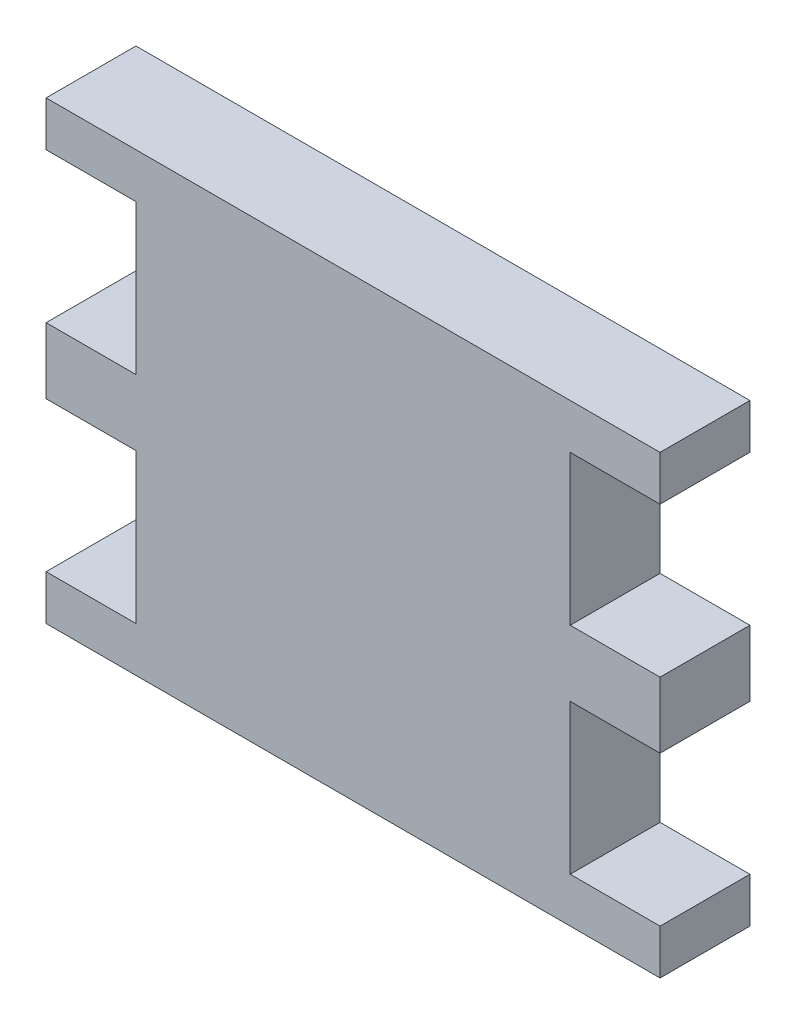
ISO-10303-21;
HEADER;
FILE_DESCRIPTION(('STEP AP214'),'2;1');
FILE_NAME('part.step','',(''),(''),'','','');
FILE_SCHEMA(('AUTOMOTIVE_DESIGN { 1 0 10303 214 1 1 1 1 }'));
ENDSEC;
DATA;
#1=APPLICATION_CONTEXT('core data for automotive mechanical design processes');
#2=APPLICATION_PROTOCOL_DEFINITION('international standard','automotive_design',2000,#1);
#3=PRODUCT_CONTEXT('',#1,'mechanical');
#4=PRODUCT('Part','Part','',(#3));
#5=PRODUCT_RELATED_PRODUCT_CATEGORY('part','',(#4));
#6=PRODUCT_DEFINITION_FORMATION('','',#4);
#7=PRODUCT_DEFINITION_CONTEXT('part definition',#1,'design');
#8=PRODUCT_DEFINITION('design','',#6,#7);
#9=PRODUCT_DEFINITION_SHAPE('','',#8);
#10=(LENGTH_UNIT() NAMED_UNIT(*) SI_UNIT(.MILLI.,.METRE.));
#11=(NAMED_UNIT(*) PLANE_ANGLE_UNIT() SI_UNIT($,.RADIAN.));
#12=(NAMED_UNIT(*) SI_UNIT($,.STERADIAN.) SOLID_ANGLE_UNIT());
#13=UNCERTAINTY_MEASURE_WITH_UNIT(LENGTH_MEASURE(1.E-05),#10,'distance_accuracy_value','');
#14=(GEOMETRIC_REPRESENTATION_CONTEXT(3) GLOBAL_UNCERTAINTY_ASSIGNED_CONTEXT((#13)) GLOBAL_UNIT_ASSIGNED_CONTEXT((#10,
#11,#12)) REPRESENTATION_CONTEXT('',''));
#15=CARTESIAN_POINT('',(0.,0.,0.));
#16=DIRECTION('',(0.,0.,1.));
#17=DIRECTION('',(1.,0.,0.));
#18=AXIS2_PLACEMENT_3D('',#15,#16,#17);
#19=CARTESIAN_POINT('',(-20.5,11.5114427860697,6.));
#20=DIRECTION('',(0.,1.,0.));
#21=DIRECTION('',(-1.,0.,0.));
#22=AXIS2_PLACEMENT_3D('',#19,#20,#21);
#23=PLANE('',#22);
#24=DIRECTION('',(1.,0.,0.));
#25=VECTOR('',#24,1.);
#26=CARTESIAN_POINT('',(-20.5,11.5114427860697,0.));
#27=LINE('',#26,#25);
#28=CARTESIAN_POINT('',(-20.5,11.5114427860697,0.));
#29=VERTEX_POINT('',#28);
#30=CARTESIAN_POINT('',(-14.5,11.5114427860696,0.));
#31=VERTEX_POINT('',#30);
#32=EDGE_CURVE('E201',#29,#31,#27,.T.);
#33=ORIENTED_EDGE('',*,*,#32,.T.);
#34=DIRECTION('',(0.,0.,-1.));
#35=VECTOR('',#34,1.);
#36=CARTESIAN_POINT('',(-14.5,11.5114427860696,6.));
#37=LINE('',#36,#35);
#38=CARTESIAN_POINT('',(-14.5,11.5114427860696,6.));
#39=VERTEX_POINT('',#38);
#40=EDGE_CURVE('E11',#39,#31,#37,.T.);
#41=ORIENTED_EDGE('',*,*,#40,.F.);
#42=DIRECTION('',(1.,0.,0.));
#43=VECTOR('',#42,1.);
#44=CARTESIAN_POINT('',(-20.5,11.5114427860697,6.));
#45=LINE('',#44,#43);
#46=CARTESIAN_POINT('',(-20.5,11.5114427860697,6.));
#47=VERTEX_POINT('',#46);
#48=EDGE_CURVE('E239',#47,#39,#45,.T.);
#49=ORIENTED_EDGE('',*,*,#48,.F.);
#50=DIRECTION('',(0.,0.,-1.));
#51=VECTOR('',#50,1.);
#52=CARTESIAN_POINT('',(-20.5,11.5114427860697,6.));
#53=LINE('',#52,#51);
#54=EDGE_CURVE('E197',#47,#29,#53,.T.);
#55=ORIENTED_EDGE('',*,*,#54,.T.);
#56=EDGE_LOOP('',(#33,#41,#49,#55));
#57=FACE_BOUND('',#56,.T.);
#58=ADVANCED_FACE('F33',(#57),#23,.F.);
#59=CARTESIAN_POINT('',(-14.5,11.5114427860696,6.));
#60=DIRECTION('',(1.,0.,0.));
#61=DIRECTION('',(0.,1.,0.));
#62=AXIS2_PLACEMENT_3D('',#59,#60,#61);
#63=PLANE('',#62);
#64=DIRECTION('',(0.,-1.,0.));
#65=VECTOR('',#64,1.);
#66=CARTESIAN_POINT('',(-14.5,11.5114427860696,0.));
#67=LINE('',#66,#65);
#68=CARTESIAN_POINT('',(-14.5,1.51144278606965,0.));
#69=VERTEX_POINT('',#68);
#70=EDGE_CURVE('E204',#31,#69,#67,.T.);
#71=ORIENTED_EDGE('',*,*,#70,.T.);
#72=DIRECTION('',(0.,0.,-1.));
#73=VECTOR('',#72,1.);
#74=CARTESIAN_POINT('',(-14.5,1.51144278606965,6.));
#75=LINE('',#74,#73);
#76=CARTESIAN_POINT('',(-14.5,1.51144278606965,6.));
#77=VERTEX_POINT('',#76);
#78=EDGE_CURVE('E41',#77,#69,#75,.T.);
#79=ORIENTED_EDGE('',*,*,#78,.F.);
#80=DIRECTION('',(0.,-1.,0.));
#81=VECTOR('',#80,1.);
#82=CARTESIAN_POINT('',(-14.5,11.5114427860696,6.));
#83=LINE('',#82,#81);
#84=EDGE_CURVE('E128',#39,#77,#83,.T.);
#85=ORIENTED_EDGE('',*,*,#84,.F.);
#86=ORIENTED_EDGE('',*,*,#40,.T.);
#87=EDGE_LOOP('',(#71,#79,#85,#86));
#88=FACE_BOUND('',#87,.T.);
#89=ADVANCED_FACE('F357',(#88),#63,.F.);
#90=CARTESIAN_POINT('',(-14.5,1.51144278606965,6.));
#91=DIRECTION('',(0.,-1.,0.));
#92=DIRECTION('',(1.,0.,0.));
#93=AXIS2_PLACEMENT_3D('',#90,#91,#92);
#94=PLANE('',#93);
#95=DIRECTION('',(-1.,0.,0.));
#96=VECTOR('',#95,1.);
#97=CARTESIAN_POINT('',(-14.5,1.51144278606965,0.));
#98=LINE('',#97,#96);
#99=CARTESIAN_POINT('',(-20.5,1.51144278606965,0.));
#100=VERTEX_POINT('',#99);
#101=EDGE_CURVE('E206',#69,#100,#98,.T.);
#102=ORIENTED_EDGE('',*,*,#101,.T.);
#103=DIRECTION('',(0.,0.,-1.));
#104=VECTOR('',#103,1.);
#105=CARTESIAN_POINT('',(-20.5,1.51144278606965,6.));
#106=LINE('',#105,#104);
#107=CARTESIAN_POINT('',(-20.5,1.51144278606965,6.));
#108=VERTEX_POINT('',#107);
#109=EDGE_CURVE('E282',#108,#100,#106,.T.);
#110=ORIENTED_EDGE('',*,*,#109,.F.);
#111=DIRECTION('',(-1.,0.,0.));
#112=VECTOR('',#111,1.);
#113=CARTESIAN_POINT('',(-14.5,1.51144278606965,6.));
#114=LINE('',#113,#112);
#115=EDGE_CURVE('E290',#77,#108,#114,.T.);
#116=ORIENTED_EDGE('',*,*,#115,.F.);
#117=ORIENTED_EDGE('',*,*,#78,.T.);
#118=EDGE_LOOP('',(#102,#110,#116,#117));
#119=FACE_BOUND('',#118,.T.);
#120=ADVANCED_FACE('F288',(#119),#94,.F.);
#121=CARTESIAN_POINT('',(-20.5,1.51144278606965,6.));
#122=DIRECTION('',(1.,0.,0.));
#123=DIRECTION('',(0.,0.,-1.));
#124=AXIS2_PLACEMENT_3D('',#121,#122,#123);
#125=PLANE('',#124);
#126=DIRECTION('',(0.,-1.,0.));
#127=VECTOR('',#126,1.);
#128=CARTESIAN_POINT('',(-20.5,1.51144278606965,0.));
#129=LINE('',#128,#127);
#130=CARTESIAN_POINT('',(-20.5,-2.88855721393036,0.));
#131=VERTEX_POINT('',#130);
#132=EDGE_CURVE('E208',#100,#131,#129,.T.);
#133=ORIENTED_EDGE('',*,*,#132,.T.);
#134=DIRECTION('',(0.,0.,-1.));
#135=VECTOR('',#134,1.);
#136=CARTESIAN_POINT('',(-20.5,-2.88855721393036,6.));
#137=LINE('',#136,#135);
#138=CARTESIAN_POINT('',(-20.5,-2.88855721393036,6.));
#139=VERTEX_POINT('',#138);
#140=EDGE_CURVE('E279',#139,#131,#137,.T.);
#141=ORIENTED_EDGE('',*,*,#140,.F.);
#142=DIRECTION('',(0.,-1.,0.));
#143=VECTOR('',#142,1.);
#144=CARTESIAN_POINT('',(-20.5,1.51144278606965,6.));
#145=LINE('',#144,#143);
#146=EDGE_CURVE('E308',#108,#139,#145,.T.);
#147=ORIENTED_EDGE('',*,*,#146,.F.);
#148=ORIENTED_EDGE('',*,*,#109,.T.);
#149=EDGE_LOOP('',(#133,#141,#147,#148));
#150=FACE_BOUND('',#149,.T.);
#151=ADVANCED_FACE('F299',(#150),#125,.F.);
#152=CARTESIAN_POINT('',(-20.5,-2.88855721393036,6.));
#153=DIRECTION('',(0.,1.,0.));
#154=DIRECTION('',(-1.,0.,0.));
#155=AXIS2_PLACEMENT_3D('',#152,#153,#154);
#156=PLANE('',#155);
#157=DIRECTION('',(1.,0.,0.));
#158=VECTOR('',#157,1.);
#159=CARTESIAN_POINT('',(-20.5,-2.88855721393036,0.));
#160=LINE('',#159,#158);
#161=CARTESIAN_POINT('',(-14.5,-2.88855721393035,0.));
#162=VERTEX_POINT('',#161);
#163=EDGE_CURVE('E210',#131,#162,#160,.T.);
#164=ORIENTED_EDGE('',*,*,#163,.T.);
#165=DIRECTION('',(0.,0.,-1.));
#166=VECTOR('',#165,1.);
#167=CARTESIAN_POINT('',(-14.5,-2.88855721393035,6.));
#168=LINE('',#167,#166);
#169=CARTESIAN_POINT('',(-14.5,-2.88855721393035,6.));
#170=VERTEX_POINT('',#169);
#171=EDGE_CURVE('E276',#170,#162,#168,.T.);
#172=ORIENTED_EDGE('',*,*,#171,.F.);
#173=DIRECTION('',(1.,0.,0.));
#174=VECTOR('',#173,1.);
#175=CARTESIAN_POINT('',(-20.5,-2.88855721393036,6.));
#176=LINE('',#175,#174);
#177=EDGE_CURVE('E305',#139,#170,#176,.T.);
#178=ORIENTED_EDGE('',*,*,#177,.F.);
#179=ORIENTED_EDGE('',*,*,#140,.T.);
#180=EDGE_LOOP('',(#164,#172,#178,#179));
#181=FACE_BOUND('',#180,.T.);
#182=ADVANCED_FACE('F303',(#181),#156,.F.);
#183=CARTESIAN_POINT('',(-14.5,-2.88855721393035,6.));
#184=DIRECTION('',(1.,0.,0.));
#185=DIRECTION('',(0.,1.,0.));
#186=AXIS2_PLACEMENT_3D('',#183,#184,#185);
#187=PLANE('',#186);
#188=DIRECTION('',(0.,-1.,0.));
#189=VECTOR('',#188,1.);
#190=CARTESIAN_POINT('',(-14.5,-2.88855721393035,0.));
#191=LINE('',#190,#189);
#192=CARTESIAN_POINT('',(-14.5,-12.8885572139304,0.));
#193=VERTEX_POINT('',#192);
#194=EDGE_CURVE('E212',#162,#193,#191,.T.);
#195=ORIENTED_EDGE('',*,*,#194,.T.);
#196=DIRECTION('',(0.,0.,-1.));
#197=VECTOR('',#196,1.);
#198=CARTESIAN_POINT('',(-14.5,-12.8885572139304,6.));
#199=LINE('',#198,#197);
#200=CARTESIAN_POINT('',(-14.5,-12.8885572139304,6.));
#201=VERTEX_POINT('',#200);
#202=EDGE_CURVE('E273',#201,#193,#199,.T.);
#203=ORIENTED_EDGE('',*,*,#202,.F.);
#204=DIRECTION('',(0.,-1.,0.));
#205=VECTOR('',#204,1.);
#206=CARTESIAN_POINT('',(-14.5,-2.88855721393035,6.));
#207=LINE('',#206,#205);
#208=EDGE_CURVE('E307',#170,#201,#207,.T.);
#209=ORIENTED_EDGE('',*,*,#208,.F.);
#210=ORIENTED_EDGE('',*,*,#171,.T.);
#211=EDGE_LOOP('',(#195,#203,#209,#210));
#212=FACE_BOUND('',#211,.T.);
#213=ADVANCED_FACE('F370',(#212),#187,.F.);
#214=CARTESIAN_POINT('',(-14.5,-12.8885572139304,6.));
#215=DIRECTION('',(0.,-1.,0.));
#216=DIRECTION('',(1.,0.,0.));
#217=AXIS2_PLACEMENT_3D('',#214,#215,#216);
#218=PLANE('',#217);
#219=DIRECTION('',(-1.,0.,0.));
#220=VECTOR('',#219,1.);
#221=CARTESIAN_POINT('',(-14.5,-12.8885572139304,0.));
#222=LINE('',#221,#220);
#223=CARTESIAN_POINT('',(-20.5,-12.8885572139304,0.));
#224=VERTEX_POINT('',#223);
#225=EDGE_CURVE('E214',#193,#224,#222,.T.);
#226=ORIENTED_EDGE('',*,*,#225,.T.);
#227=DIRECTION('',(0.,0.,-1.));
#228=VECTOR('',#227,1.);
#229=CARTESIAN_POINT('',(-20.5,-12.8885572139304,6.));
#230=LINE('',#229,#228);
#231=CARTESIAN_POINT('',(-20.5,-12.8885572139304,6.));
#232=VERTEX_POINT('',#231);
#233=EDGE_CURVE('E270',#232,#224,#230,.T.);
#234=ORIENTED_EDGE('',*,*,#233,.F.);
#235=DIRECTION('',(-1.,0.,0.));
#236=VECTOR('',#235,1.);
#237=CARTESIAN_POINT('',(-14.5,-12.8885572139304,6.));
#238=LINE('',#237,#236);
#239=EDGE_CURVE('E310',#201,#232,#238,.T.);
#240=ORIENTED_EDGE('',*,*,#239,.F.);
#241=ORIENTED_EDGE('',*,*,#202,.T.);
#242=EDGE_LOOP('',(#226,#234,#240,#241));
#243=FACE_BOUND('',#242,.T.);
#244=ADVANCED_FACE('F373',(#243),#218,.F.);
#245=CARTESIAN_POINT('',(-20.5,-12.8885572139304,6.));
#246=DIRECTION('',(1.,0.,0.));
#247=DIRECTION('',(0.,1.,0.));
#248=AXIS2_PLACEMENT_3D('',#245,#246,#247);
#249=PLANE('',#248);
#250=DIRECTION('',(0.,-1.,0.));
#251=VECTOR('',#250,1.);
#252=CARTESIAN_POINT('',(-20.5,-12.8885572139304,0.));
#253=LINE('',#252,#251);
#254=CARTESIAN_POINT('',(-20.5,-15.8885572139303,0.));
#255=VERTEX_POINT('',#254);
#256=EDGE_CURVE('E216',#224,#255,#253,.T.);
#257=ORIENTED_EDGE('',*,*,#256,.T.);
#258=DIRECTION('',(0.,0.,-1.));
#259=VECTOR('',#258,1.);
#260=CARTESIAN_POINT('',(-20.5,-15.8885572139303,6.));
#261=LINE('',#260,#259);
#262=CARTESIAN_POINT('',(-20.5,-15.8885572139303,6.));
#263=VERTEX_POINT('',#262);
#264=EDGE_CURVE('E267',#263,#255,#261,.T.);
#265=ORIENTED_EDGE('',*,*,#264,.F.);
#266=DIRECTION('',(0.,-1.,0.));
#267=VECTOR('',#266,1.);
#268=CARTESIAN_POINT('',(-20.5,-12.8885572139304,6.));
#269=LINE('',#268,#267);
#270=EDGE_CURVE('E316',#232,#263,#269,.T.);
#271=ORIENTED_EDGE('',*,*,#270,.F.);
#272=ORIENTED_EDGE('',*,*,#233,.T.);
#273=EDGE_LOOP('',(#257,#265,#271,#272));
#274=FACE_BOUND('',#273,.T.);
#275=ADVANCED_FACE('F377',(#274),#249,.F.);
#276=CARTESIAN_POINT('',(-20.5,-15.8885572139303,6.));
#277=DIRECTION('',(0.,1.,0.));
#278=DIRECTION('',(-1.,0.,0.));
#279=AXIS2_PLACEMENT_3D('',#276,#277,#278);
#280=PLANE('',#279);
#281=DIRECTION('',(1.,0.,0.));
#282=VECTOR('',#281,1.);
#283=CARTESIAN_POINT('',(-20.5,-15.8885572139303,0.));
#284=LINE('',#283,#282);
#285=CARTESIAN_POINT('',(20.5,-15.8885572139303,0.));
#286=VERTEX_POINT('',#285);
#287=EDGE_CURVE('E218',#255,#286,#284,.T.);
#288=ORIENTED_EDGE('',*,*,#287,.T.);
#289=DIRECTION('',(0.,0.,-1.));
#290=VECTOR('',#289,1.);
#291=CARTESIAN_POINT('',(20.5,-15.8885572139303,6.));
#292=LINE('',#291,#290);
#293=CARTESIAN_POINT('',(20.5,-15.8885572139303,6.));
#294=VERTEX_POINT('',#293);
#295=EDGE_CURVE('E264',#294,#286,#292,.T.);
#296=ORIENTED_EDGE('',*,*,#295,.F.);
#297=DIRECTION('',(1.,0.,0.));
#298=VECTOR('',#297,1.);
#299=CARTESIAN_POINT('',(-20.5,-15.8885572139303,6.));
#300=LINE('',#299,#298);
#301=EDGE_CURVE('E318',#263,#294,#300,.T.);
#302=ORIENTED_EDGE('',*,*,#301,.F.);
#303=ORIENTED_EDGE('',*,*,#264,.T.);
#304=EDGE_LOOP('',(#288,#296,#302,#303));
#305=FACE_BOUND('',#304,.T.);
#306=ADVANCED_FACE('F381',(#305),#280,.F.);
#307=CARTESIAN_POINT('',(20.5,-12.8885572139303,6.));
#308=DIRECTION('',(-1.,0.,0.));
#309=DIRECTION('',(0.,-1.,0.));
#310=AXIS2_PLACEMENT_3D('',#307,#308,#309);
#311=PLANE('',#310);
#312=DIRECTION('',(0.,1.,0.));
#313=VECTOR('',#312,1.);
#314=CARTESIAN_POINT('',(20.5,-12.8885572139303,0.));
#315=LINE('',#314,#313);
#316=CARTESIAN_POINT('',(20.5,-12.8885572139303,0.));
#317=VERTEX_POINT('',#316);
#318=EDGE_CURVE('E220',#286,#317,#315,.T.);
#319=ORIENTED_EDGE('',*,*,#318,.T.);
#320=DIRECTION('',(0.,0.,-1.));
#321=VECTOR('',#320,1.);
#322=CARTESIAN_POINT('',(20.5,-12.8885572139303,6.));
#323=LINE('',#322,#321);
#324=CARTESIAN_POINT('',(20.5,-12.8885572139303,6.));
#325=VERTEX_POINT('',#324);
#326=EDGE_CURVE('E261',#325,#317,#323,.T.);
#327=ORIENTED_EDGE('',*,*,#326,.F.);
#328=DIRECTION('',(0.,1.,0.));
#329=VECTOR('',#328,1.);
#330=CARTESIAN_POINT('',(20.5,-12.8885572139303,6.));
#331=LINE('',#330,#329);
#332=EDGE_CURVE('E320',#294,#325,#331,.T.);
#333=ORIENTED_EDGE('',*,*,#332,.F.);
#334=ORIENTED_EDGE('',*,*,#295,.T.);
#335=EDGE_LOOP('',(#319,#327,#333,#334));
#336=FACE_BOUND('',#335,.T.);
#337=ADVANCED_FACE('F385',(#336),#311,.F.);
#338=CARTESIAN_POINT('',(14.5,-12.8885572139304,6.));
#339=DIRECTION('',(0.,-1.,0.));
#340=DIRECTION('',(1.,0.,0.));
#341=AXIS2_PLACEMENT_3D('',#338,#339,#340);
#342=PLANE('',#341);
#343=DIRECTION('',(-1.,0.,0.));
#344=VECTOR('',#343,1.);
#345=CARTESIAN_POINT('',(14.5,-12.8885572139304,0.));
#346=LINE('',#345,#344);
#347=CARTESIAN_POINT('',(14.5,-12.8885572139304,0.));
#348=VERTEX_POINT('',#347);
#349=EDGE_CURVE('E222',#317,#348,#346,.T.);
#350=ORIENTED_EDGE('',*,*,#349,.T.);
#351=DIRECTION('',(0.,0.,-1.));
#352=VECTOR('',#351,1.);
#353=CARTESIAN_POINT('',(14.5,-12.8885572139304,6.));
#354=LINE('',#353,#352);
#355=CARTESIAN_POINT('',(14.5,-12.8885572139304,6.));
#356=VERTEX_POINT('',#355);
#357=EDGE_CURVE('E258',#356,#348,#354,.T.);
#358=ORIENTED_EDGE('',*,*,#357,.F.);
#359=DIRECTION('',(-1.,0.,0.));
#360=VECTOR('',#359,1.);
#361=CARTESIAN_POINT('',(14.5,-12.8885572139304,6.));
#362=LINE('',#361,#360);
#363=EDGE_CURVE('E322',#325,#356,#362,.T.);
#364=ORIENTED_EDGE('',*,*,#363,.F.);
#365=ORIENTED_EDGE('',*,*,#326,.T.);
#366=EDGE_LOOP('',(#350,#358,#364,#365));
#367=FACE_BOUND('',#366,.T.);
#368=ADVANCED_FACE('F389',(#367),#342,.F.);
#369=CARTESIAN_POINT('',(14.5,-2.88855721393035,6.));
#370=DIRECTION('',(-1.,0.,0.));
#371=DIRECTION('',(0.,-1.,0.));
#372=AXIS2_PLACEMENT_3D('',#369,#370,#371);
#373=PLANE('',#372);
#374=DIRECTION('',(0.,1.,0.));
#375=VECTOR('',#374,1.);
#376=CARTESIAN_POINT('',(14.5,-2.88855721393035,0.));
#377=LINE('',#376,#375);
#378=CARTESIAN_POINT('',(14.5,-2.88855721393035,0.));
#379=VERTEX_POINT('',#378);
#380=EDGE_CURVE('E224',#348,#379,#377,.T.);
#381=ORIENTED_EDGE('',*,*,#380,.T.);
#382=DIRECTION('',(0.,0.,-1.));
#383=VECTOR('',#382,1.);
#384=CARTESIAN_POINT('',(14.5,-2.88855721393035,6.));
#385=LINE('',#384,#383);
#386=CARTESIAN_POINT('',(14.5,-2.88855721393035,6.));
#387=VERTEX_POINT('',#386);
#388=EDGE_CURVE('E255',#387,#379,#385,.T.);
#389=ORIENTED_EDGE('',*,*,#388,.F.);
#390=DIRECTION('',(0.,1.,0.));
#391=VECTOR('',#390,1.);
#392=CARTESIAN_POINT('',(14.5,-2.88855721393035,6.));
#393=LINE('',#392,#391);
#394=EDGE_CURVE('E324',#356,#387,#393,.T.);
#395=ORIENTED_EDGE('',*,*,#394,.F.);
#396=ORIENTED_EDGE('',*,*,#357,.T.);
#397=EDGE_LOOP('',(#381,#389,#395,#396));
#398=FACE_BOUND('',#397,.T.);
#399=ADVANCED_FACE('F393',(#398),#373,.F.);
#400=CARTESIAN_POINT('',(20.5,-2.88855721393035,6.));
#401=DIRECTION('',(0.,1.,0.));
#402=DIRECTION('',(-1.,0.,0.));
#403=AXIS2_PLACEMENT_3D('',#400,#401,#402);
#404=PLANE('',#403);
#405=DIRECTION('',(1.,0.,0.));
#406=VECTOR('',#405,1.);
#407=CARTESIAN_POINT('',(20.5,-2.88855721393035,0.));
#408=LINE('',#407,#406);
#409=CARTESIAN_POINT('',(20.5,-2.88855721393035,0.));
#410=VERTEX_POINT('',#409);
#411=EDGE_CURVE('E226',#379,#410,#408,.T.);
#412=ORIENTED_EDGE('',*,*,#411,.T.);
#413=DIRECTION('',(0.,0.,-1.));
#414=VECTOR('',#413,1.);
#415=CARTESIAN_POINT('',(20.5,-2.88855721393035,6.));
#416=LINE('',#415,#414);
#417=CARTESIAN_POINT('',(20.5,-2.88855721393035,6.));
#418=VERTEX_POINT('',#417);
#419=EDGE_CURVE('E252',#418,#410,#416,.T.);
#420=ORIENTED_EDGE('',*,*,#419,.F.);
#421=DIRECTION('',(1.,0.,0.));
#422=VECTOR('',#421,1.);
#423=CARTESIAN_POINT('',(20.5,-2.88855721393035,6.));
#424=LINE('',#423,#422);
#425=EDGE_CURVE('E326',#387,#418,#424,.T.);
#426=ORIENTED_EDGE('',*,*,#425,.F.);
#427=ORIENTED_EDGE('',*,*,#388,.T.);
#428=EDGE_LOOP('',(#412,#420,#426,#427));
#429=FACE_BOUND('',#428,.T.);
#430=ADVANCED_FACE('F397',(#429),#404,.F.);
#431=CARTESIAN_POINT('',(20.5,1.51144278606965,6.));
#432=DIRECTION('',(-1.,0.,0.));
#433=DIRECTION('',(0.,0.,1.));
#434=AXIS2_PLACEMENT_3D('',#431,#432,#433);
#435=PLANE('',#434);
#436=DIRECTION('',(0.,1.,0.));
#437=VECTOR('',#436,1.);
#438=CARTESIAN_POINT('',(20.5,1.51144278606965,0.));
#439=LINE('',#438,#437);
#440=CARTESIAN_POINT('',(20.5,1.51144278606965,0.));
#441=VERTEX_POINT('',#440);
#442=EDGE_CURVE('E228',#410,#441,#439,.T.);
#443=ORIENTED_EDGE('',*,*,#442,.T.);
#444=DIRECTION('',(0.,0.,-1.));
#445=VECTOR('',#444,1.);
#446=CARTESIAN_POINT('',(20.5,1.51144278606965,6.));
#447=LINE('',#446,#445);
#448=CARTESIAN_POINT('',(20.5,1.51144278606965,6.));
#449=VERTEX_POINT('',#448);
#450=EDGE_CURVE('E249',#449,#441,#447,.T.);
#451=ORIENTED_EDGE('',*,*,#450,.F.);
#452=DIRECTION('',(0.,1.,0.));
#453=VECTOR('',#452,1.);
#454=CARTESIAN_POINT('',(20.5,1.51144278606965,6.));
#455=LINE('',#454,#453);
#456=EDGE_CURVE('E328',#418,#449,#455,.T.);
#457=ORIENTED_EDGE('',*,*,#456,.F.);
#458=ORIENTED_EDGE('',*,*,#419,.T.);
#459=EDGE_LOOP('',(#443,#451,#457,#458));
#460=FACE_BOUND('',#459,.T.);
#461=ADVANCED_FACE('F401',(#460),#435,.F.);
#462=CARTESIAN_POINT('',(14.5,1.51144278606965,6.));
#463=DIRECTION('',(0.,-1.,0.));
#464=DIRECTION('',(1.,0.,0.));
#465=AXIS2_PLACEMENT_3D('',#462,#463,#464);
#466=PLANE('',#465);
#467=DIRECTION('',(-1.,0.,0.));
#468=VECTOR('',#467,1.);
#469=CARTESIAN_POINT('',(14.5,1.51144278606965,0.));
#470=LINE('',#469,#468);
#471=CARTESIAN_POINT('',(14.5,1.51144278606965,0.));
#472=VERTEX_POINT('',#471);
#473=EDGE_CURVE('E230',#441,#472,#470,.T.);
#474=ORIENTED_EDGE('',*,*,#473,.T.);
#475=DIRECTION('',(0.,0.,-1.));
#476=VECTOR('',#475,1.);
#477=CARTESIAN_POINT('',(14.5,1.51144278606965,6.));
#478=LINE('',#477,#476);
#479=CARTESIAN_POINT('',(14.5,1.51144278606965,6.));
#480=VERTEX_POINT('',#479);
#481=EDGE_CURVE('E246',#480,#472,#478,.T.);
#482=ORIENTED_EDGE('',*,*,#481,.F.);
#483=DIRECTION('',(-1.,0.,0.));
#484=VECTOR('',#483,1.);
#485=CARTESIAN_POINT('',(14.5,1.51144278606965,6.));
#486=LINE('',#485,#484);
#487=EDGE_CURVE('E330',#449,#480,#486,.T.);
#488=ORIENTED_EDGE('',*,*,#487,.F.);
#489=ORIENTED_EDGE('',*,*,#450,.T.);
#490=EDGE_LOOP('',(#474,#482,#488,#489));
#491=FACE_BOUND('',#490,.T.);
#492=ADVANCED_FACE('F405',(#491),#466,.F.);
#493=CARTESIAN_POINT('',(14.5,11.5114427860697,6.));
#494=DIRECTION('',(-1.,0.,0.));
#495=DIRECTION('',(0.,-1.,0.));
#496=AXIS2_PLACEMENT_3D('',#493,#494,#495);
#497=PLANE('',#496);
#498=DIRECTION('',(0.,1.,0.));
#499=VECTOR('',#498,1.);
#500=CARTESIAN_POINT('',(14.5,11.5114427860697,0.));
#501=LINE('',#500,#499);
#502=CARTESIAN_POINT('',(14.5,11.5114427860697,0.));
#503=VERTEX_POINT('',#502);
#504=EDGE_CURVE('E232',#472,#503,#501,.T.);
#505=ORIENTED_EDGE('',*,*,#504,.T.);
#506=DIRECTION('',(0.,0.,-1.));
#507=VECTOR('',#506,1.);
#508=CARTESIAN_POINT('',(14.5,11.5114427860697,6.));
#509=LINE('',#508,#507);
#510=CARTESIAN_POINT('',(14.5,11.5114427860697,6.));
#511=VERTEX_POINT('',#510);
#512=EDGE_CURVE('E243',#511,#503,#509,.T.);
#513=ORIENTED_EDGE('',*,*,#512,.F.);
#514=DIRECTION('',(0.,1.,0.));
#515=VECTOR('',#514,1.);
#516=CARTESIAN_POINT('',(14.5,11.5114427860697,6.));
#517=LINE('',#516,#515);
#518=EDGE_CURVE('E332',#480,#511,#517,.T.);
#519=ORIENTED_EDGE('',*,*,#518,.F.);
#520=ORIENTED_EDGE('',*,*,#481,.T.);
#521=EDGE_LOOP('',(#505,#513,#519,#520));
#522=FACE_BOUND('',#521,.T.);
#523=ADVANCED_FACE('F338',(#522),#497,.F.);
#524=CARTESIAN_POINT('',(20.5,11.5114427860697,6.));
#525=DIRECTION('',(0.,1.,0.));
#526=DIRECTION('',(-1.,0.,0.));
#527=AXIS2_PLACEMENT_3D('',#524,#525,#526);
#528=PLANE('',#527);
#529=DIRECTION('',(1.,0.,0.));
#530=VECTOR('',#529,1.);
#531=CARTESIAN_POINT('',(20.5,11.5114427860697,0.));
#532=LINE('',#531,#530);
#533=CARTESIAN_POINT('',(20.5,11.5114427860697,0.));
#534=VERTEX_POINT('',#533);
#535=EDGE_CURVE('E234',#503,#534,#532,.T.);
#536=ORIENTED_EDGE('',*,*,#535,.T.);
#537=DIRECTION('',(0.,0.,-1.));
#538=VECTOR('',#537,1.);
#539=CARTESIAN_POINT('',(20.5,11.5114427860697,6.));
#540=LINE('',#539,#538);
#541=CARTESIAN_POINT('',(20.5,11.5114427860697,6.));
#542=VERTEX_POINT('',#541);
#543=EDGE_CURVE('E192',#542,#534,#540,.T.);
#544=ORIENTED_EDGE('',*,*,#543,.F.);
#545=DIRECTION('',(1.,0.,0.));
#546=VECTOR('',#545,1.);
#547=CARTESIAN_POINT('',(20.5,11.5114427860697,6.));
#548=LINE('',#547,#546);
#549=EDGE_CURVE('E183',#511,#542,#548,.T.);
#550=ORIENTED_EDGE('',*,*,#549,.F.);
#551=ORIENTED_EDGE('',*,*,#512,.T.);
#552=EDGE_LOOP('',(#536,#544,#550,#551));
#553=FACE_BOUND('',#552,.T.);
#554=ADVANCED_FACE('F342',(#553),#528,.F.);
#555=CARTESIAN_POINT('',(20.5,14.5114427860697,6.));
#556=DIRECTION('',(-1.,0.,0.));
#557=DIRECTION('',(0.,-1.,0.));
#558=AXIS2_PLACEMENT_3D('',#555,#556,#557);
#559=PLANE('',#558);
#560=DIRECTION('',(0.,1.,0.));
#561=VECTOR('',#560,1.);
#562=CARTESIAN_POINT('',(20.5,14.5114427860697,0.));
#563=LINE('',#562,#561);
#564=CARTESIAN_POINT('',(20.5,14.5114427860697,0.));
#565=VERTEX_POINT('',#564);
#566=EDGE_CURVE('E191',#534,#565,#563,.T.);
#567=ORIENTED_EDGE('',*,*,#566,.T.);
#568=DIRECTION('',(0.,0.,-1.));
#569=VECTOR('',#568,1.);
#570=CARTESIAN_POINT('',(20.5,14.5114427860697,6.));
#571=LINE('',#570,#569);
#572=CARTESIAN_POINT('',(20.5,14.5114427860697,6.));
#573=VERTEX_POINT('',#572);
#574=EDGE_CURVE('E188',#573,#565,#571,.T.);
#575=ORIENTED_EDGE('',*,*,#574,.F.);
#576=DIRECTION('',(0.,1.,0.));
#577=VECTOR('',#576,1.);
#578=CARTESIAN_POINT('',(20.5,14.5114427860697,6.));
#579=LINE('',#578,#577);
#580=EDGE_CURVE('E177',#542,#573,#579,.T.);
#581=ORIENTED_EDGE('',*,*,#580,.F.);
#582=ORIENTED_EDGE('',*,*,#543,.T.);
#583=EDGE_LOOP('',(#567,#575,#581,#582));
#584=FACE_BOUND('',#583,.T.);
#585=ADVANCED_FACE('F189',(#584),#559,.F.);
#586=CARTESIAN_POINT('',(-20.5,14.5114427860696,6.));
#587=DIRECTION('',(0.,-1.,0.));
#588=DIRECTION('',(1.,0.,0.));
#589=AXIS2_PLACEMENT_3D('',#586,#587,#588);
#590=PLANE('',#589);
#591=DIRECTION('',(-1.,0.,0.));
#592=VECTOR('',#591,1.);
#593=CARTESIAN_POINT('',(-20.5,14.5114427860696,0.));
#594=LINE('',#593,#592);
#595=CARTESIAN_POINT('',(-20.5,14.5114427860696,0.));
#596=VERTEX_POINT('',#595);
#597=EDGE_CURVE('E114',#565,#596,#594,.T.);
#598=ORIENTED_EDGE('',*,*,#597,.T.);
#599=DIRECTION('',(0.,0.,-1.));
#600=VECTOR('',#599,1.);
#601=CARTESIAN_POINT('',(-20.5,14.5114427860696,6.));
#602=LINE('',#601,#600);
#603=CARTESIAN_POINT('',(-20.5,14.5114427860696,6.));
#604=VERTEX_POINT('',#603);
#605=EDGE_CURVE('E193',#604,#596,#602,.T.);
#606=ORIENTED_EDGE('',*,*,#605,.F.);
#607=DIRECTION('',(-1.,0.,0.));
#608=VECTOR('',#607,1.);
#609=CARTESIAN_POINT('',(-20.5,14.5114427860696,6.));
#610=LINE('',#609,#608);
#611=EDGE_CURVE('E181',#573,#604,#610,.T.);
#612=ORIENTED_EDGE('',*,*,#611,.F.);
#613=ORIENTED_EDGE('',*,*,#574,.T.);
#614=EDGE_LOOP('',(#598,#606,#612,#613));
#615=FACE_BOUND('',#614,.T.);
#616=ADVANCED_FACE('F195',(#615),#590,.F.);
#617=CARTESIAN_POINT('',(-20.5,14.5114427860696,6.));
#618=DIRECTION('',(1.,0.,0.));
#619=DIRECTION('',(0.,1.,0.));
#620=AXIS2_PLACEMENT_3D('',#617,#618,#619);
#621=PLANE('',#620);
#622=DIRECTION('',(0.,-1.,0.));
#623=VECTOR('',#622,1.);
#624=CARTESIAN_POINT('',(-20.5,14.5114427860696,0.));
#625=LINE('',#624,#623);
#626=EDGE_CURVE('E120',#596,#29,#625,.T.);
#627=ORIENTED_EDGE('',*,*,#626,.T.);
#628=ORIENTED_EDGE('',*,*,#54,.F.);
#629=DIRECTION('',(0.,-1.,0.));
#630=VECTOR('',#629,1.);
#631=CARTESIAN_POINT('',(-20.5,14.5114427860696,6.));
#632=LINE('',#631,#630);
#633=EDGE_CURVE('E49',#604,#47,#632,.T.);
#634=ORIENTED_EDGE('',*,*,#633,.F.);
#635=ORIENTED_EDGE('',*,*,#605,.T.);
#636=EDGE_LOOP('',(#627,#628,#634,#635));
#637=FACE_BOUND('',#636,.T.);
#638=ADVANCED_FACE('F346',(#637),#621,.F.);
#639=CARTESIAN_POINT('',(0.,0.,6.));
#640=DIRECTION('',(0.,0.,-1.));
#641=DIRECTION('',(-1.,0.,0.));
#642=AXIS2_PLACEMENT_3D('',#639,#640,#641);
#643=PLANE('',#642);
#644=ORIENTED_EDGE('',*,*,#48,.T.);
#645=ORIENTED_EDGE('',*,*,#84,.T.);
#646=ORIENTED_EDGE('',*,*,#115,.T.);
#647=ORIENTED_EDGE('',*,*,#146,.T.);
#648=ORIENTED_EDGE('',*,*,#177,.T.);
#649=ORIENTED_EDGE('',*,*,#208,.T.);
#650=ORIENTED_EDGE('',*,*,#239,.T.);
#651=ORIENTED_EDGE('',*,*,#270,.T.);
#652=ORIENTED_EDGE('',*,*,#301,.T.);
#653=ORIENTED_EDGE('',*,*,#332,.T.);
#654=ORIENTED_EDGE('',*,*,#363,.T.);
#655=ORIENTED_EDGE('',*,*,#394,.T.);
#656=ORIENTED_EDGE('',*,*,#425,.T.);
#657=ORIENTED_EDGE('',*,*,#456,.T.);
#658=ORIENTED_EDGE('',*,*,#487,.T.);
#659=ORIENTED_EDGE('',*,*,#518,.T.);
#660=ORIENTED_EDGE('',*,*,#549,.T.);
#661=ORIENTED_EDGE('',*,*,#580,.T.);
#662=ORIENTED_EDGE('',*,*,#611,.T.);
#663=ORIENTED_EDGE('',*,*,#633,.T.);
#664=EDGE_LOOP('',(#644,#645,#646,#647,#648,#649,#650,#651,#652,#653,#654,#655,#656,#657,#658,
#659,#660,#661,#662,#663));
#665=FACE_BOUND('',#664,.T.);
#666=ADVANCED_FACE('F179',(#665),#643,.F.);
#667=CARTESIAN_POINT('',(0.,0.,0.));
#668=DIRECTION('',(0.,0.,-1.));
#669=DIRECTION('',(-1.,0.,0.));
#670=AXIS2_PLACEMENT_3D('',#667,#668,#669);
#671=PLANE('',#670);
#672=ORIENTED_EDGE('',*,*,#32,.F.);
#673=ORIENTED_EDGE('',*,*,#626,.F.);
#674=ORIENTED_EDGE('',*,*,#597,.F.);
#675=ORIENTED_EDGE('',*,*,#566,.F.);
#676=ORIENTED_EDGE('',*,*,#535,.F.);
#677=ORIENTED_EDGE('',*,*,#504,.F.);
#678=ORIENTED_EDGE('',*,*,#473,.F.);
#679=ORIENTED_EDGE('',*,*,#442,.F.);
#680=ORIENTED_EDGE('',*,*,#411,.F.);
#681=ORIENTED_EDGE('',*,*,#380,.F.);
#682=ORIENTED_EDGE('',*,*,#349,.F.);
#683=ORIENTED_EDGE('',*,*,#318,.F.);
#684=ORIENTED_EDGE('',*,*,#287,.F.);
#685=ORIENTED_EDGE('',*,*,#256,.F.);
#686=ORIENTED_EDGE('',*,*,#225,.F.);
#687=ORIENTED_EDGE('',*,*,#194,.F.);
#688=ORIENTED_EDGE('',*,*,#163,.F.);
#689=ORIENTED_EDGE('',*,*,#132,.F.);
#690=ORIENTED_EDGE('',*,*,#101,.F.);
#691=ORIENTED_EDGE('',*,*,#70,.F.);
#692=EDGE_LOOP('',(#672,#673,#674,#675,#676,#677,#678,#679,#680,#681,#682,#683,#684,#685,#686,
#687,#688,#689,#690,#691));
#693=FACE_BOUND('',#692,.T.);
#694=ADVANCED_FACE('F294',(#693),#671,.T.);
#695=CLOSED_SHELL('',(#58,#89,#120,#151,#182,#213,#244,#275,#306,#337,#368,#399,#430,#461,#492,
#523,#554,#585,#616,#638,#666,#694));
#696=MANIFOLD_SOLID_BREP('B2',#695);
#697=ADVANCED_BREP_SHAPE_REPRESENTATION('',(#18,#696),#14);
#698=SHAPE_DEFINITION_REPRESENTATION(#9,#697);
ENDSEC;
END-ISO-10303-21;
